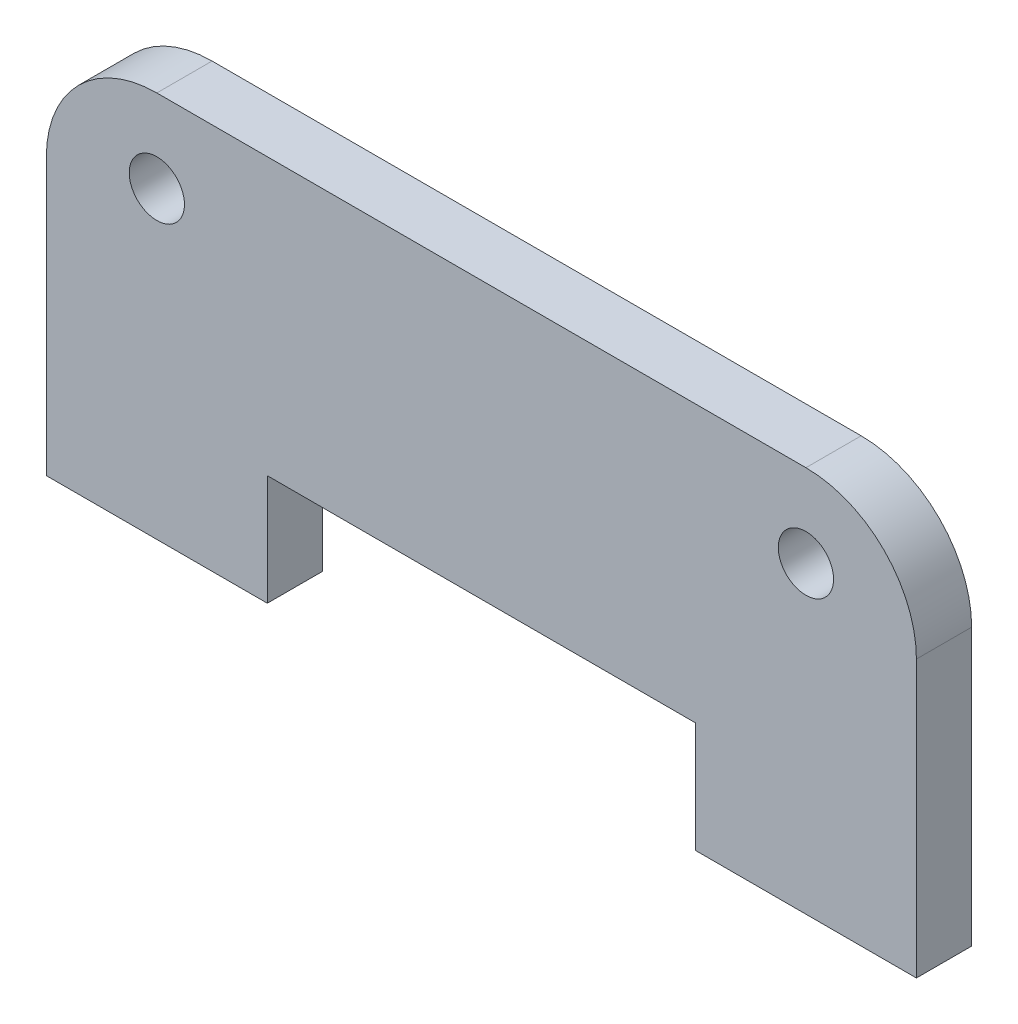
ISO-10303-21;
HEADER;
FILE_DESCRIPTION(('STEP AP214'),'2;1');
FILE_NAME('part.step','',(''),(''),'','','');
FILE_SCHEMA(('AUTOMOTIVE_DESIGN { 1 0 10303 214 1 1 1 1 }'));
ENDSEC;
DATA;
#1=APPLICATION_CONTEXT('core data for automotive mechanical design processes');
#2=APPLICATION_PROTOCOL_DEFINITION('international standard','automotive_design',2000,#1);
#3=PRODUCT_CONTEXT('',#1,'mechanical');
#4=PRODUCT('Part','Part','',(#3));
#5=PRODUCT_RELATED_PRODUCT_CATEGORY('part','',(#4));
#6=PRODUCT_DEFINITION_FORMATION('','',#4);
#7=PRODUCT_DEFINITION_CONTEXT('part definition',#1,'design');
#8=PRODUCT_DEFINITION('design','',#6,#7);
#9=PRODUCT_DEFINITION_SHAPE('','',#8);
#10=(LENGTH_UNIT() NAMED_UNIT(*) SI_UNIT(.MILLI.,.METRE.));
#11=(NAMED_UNIT(*) PLANE_ANGLE_UNIT() SI_UNIT($,.RADIAN.));
#12=(NAMED_UNIT(*) SI_UNIT($,.STERADIAN.) SOLID_ANGLE_UNIT());
#13=UNCERTAINTY_MEASURE_WITH_UNIT(LENGTH_MEASURE(1.E-05),#10,'distance_accuracy_value','');
#14=(GEOMETRIC_REPRESENTATION_CONTEXT(3) GLOBAL_UNCERTAINTY_ASSIGNED_CONTEXT((#13)) GLOBAL_UNIT_ASSIGNED_CONTEXT((#10,
#11,#12)) REPRESENTATION_CONTEXT('',''));
#15=CARTESIAN_POINT('',(0.,0.,0.));
#16=DIRECTION('',(0.,0.,1.));
#17=DIRECTION('',(1.,0.,0.));
#18=AXIS2_PLACEMENT_3D('',#15,#16,#17);
#19=CARTESIAN_POINT('',(-11.75,-1.,2.));
#20=DIRECTION('',(0.,0.,1.));
#21=DIRECTION('',(1.,0.,0.));
#22=AXIS2_PLACEMENT_3D('',#19,#20,#21);
#23=PLANE('',#22);
#24=CARTESIAN_POINT('',(-11.75,0.,2.));
#25=DIRECTION('',(0.,0.,1.));
#26=DIRECTION('',(1.,0.,0.));
#27=AXIS2_PLACEMENT_3D('',#24,#25,#26);
#28=CIRCLE('',#27,0.999999999999998);
#29=CARTESIAN_POINT('',(-10.75,0.,2.));
#30=VERTEX_POINT('',#29);
#31=EDGE_CURVE('E143',#30,#30,#28,.T.);
#32=ORIENTED_EDGE('',*,*,#31,.F.);
#33=EDGE_LOOP('',(#32));
#34=FACE_BOUND('',#33,.T.);
#35=DIRECTION('',(0.,1.,0.));
#36=VECTOR('',#35,1.);
#37=CARTESIAN_POINT('',(15.75,-7.,2.));
#38=LINE('',#37,#36);
#39=CARTESIAN_POINT('',(15.75,-11.,2.));
#40=VERTEX_POINT('',#39);
#41=CARTESIAN_POINT('',(15.75,-1.,2.));
#42=VERTEX_POINT('',#41);
#43=EDGE_CURVE('E97',#40,#42,#38,.T.);
#44=ORIENTED_EDGE('',*,*,#43,.T.);
#45=CARTESIAN_POINT('',(11.75,-1.,2.));
#46=DIRECTION('',(0.,0.,1.));
#47=DIRECTION('',(1.,0.,0.));
#48=AXIS2_PLACEMENT_3D('',#45,#46,#47);
#49=CIRCLE('',#48,4.);
#50=CARTESIAN_POINT('',(11.75,3.,2.));
#51=VERTEX_POINT('',#50);
#52=EDGE_CURVE('E206',#42,#51,#49,.T.);
#53=ORIENTED_EDGE('',*,*,#52,.T.);
#54=DIRECTION('',(-1.,0.,0.));
#55=VECTOR('',#54,1.);
#56=CARTESIAN_POINT('',(-11.75,3.,2.));
#57=LINE('',#56,#55);
#58=CARTESIAN_POINT('',(-11.75,3.,2.));
#59=VERTEX_POINT('',#58);
#60=EDGE_CURVE('E182',#51,#59,#57,.T.);
#61=ORIENTED_EDGE('',*,*,#60,.T.);
#62=CARTESIAN_POINT('',(-11.75,-1.,2.));
#63=DIRECTION('',(0.,0.,1.));
#64=DIRECTION('',(1.,0.,0.));
#65=AXIS2_PLACEMENT_3D('',#62,#63,#64);
#66=CIRCLE('',#65,4.);
#67=CARTESIAN_POINT('',(-15.75,-1.,2.));
#68=VERTEX_POINT('',#67);
#69=EDGE_CURVE('E200',#59,#68,#66,.T.);
#70=ORIENTED_EDGE('',*,*,#69,.T.);
#71=DIRECTION('',(0.,-1.,0.));
#72=VECTOR('',#71,1.);
#73=CARTESIAN_POINT('',(-15.75,-1.,2.));
#74=LINE('',#73,#72);
#75=CARTESIAN_POINT('',(-15.75,-11.,2.));
#76=VERTEX_POINT('',#75);
#77=EDGE_CURVE('E197',#68,#76,#74,.T.);
#78=ORIENTED_EDGE('',*,*,#77,.T.);
#79=DIRECTION('',(1.,0.,0.));
#80=VECTOR('',#79,1.);
#81=CARTESIAN_POINT('',(-15.75,-11.,2.));
#82=LINE('',#81,#80);
#83=CARTESIAN_POINT('',(-7.75,-11.,2.));
#84=VERTEX_POINT('',#83);
#85=EDGE_CURVE('E199',#76,#84,#82,.T.);
#86=ORIENTED_EDGE('',*,*,#85,.T.);
#87=DIRECTION('',(0.,1.,0.));
#88=VECTOR('',#87,1.);
#89=CARTESIAN_POINT('',(-7.75,-11.,2.));
#90=LINE('',#89,#88);
#91=CARTESIAN_POINT('',(-7.75,-7.,2.));
#92=VERTEX_POINT('',#91);
#93=EDGE_CURVE('E123',#84,#92,#90,.T.);
#94=ORIENTED_EDGE('',*,*,#93,.T.);
#95=DIRECTION('',(1.,0.,0.));
#96=VECTOR('',#95,1.);
#97=CARTESIAN_POINT('',(-7.75,-7.,2.));
#98=LINE('',#97,#96);
#99=CARTESIAN_POINT('',(7.75,-7.,2.));
#100=VERTEX_POINT('',#99);
#101=EDGE_CURVE('E117',#92,#100,#98,.T.);
#102=ORIENTED_EDGE('',*,*,#101,.T.);
#103=DIRECTION('',(0.,-1.,0.));
#104=VECTOR('',#103,1.);
#105=CARTESIAN_POINT('',(7.75,-11.,2.));
#106=LINE('',#105,#104);
#107=CARTESIAN_POINT('',(7.75,-11.,2.));
#108=VERTEX_POINT('',#107);
#109=EDGE_CURVE('E121',#100,#108,#106,.T.);
#110=ORIENTED_EDGE('',*,*,#109,.T.);
#111=DIRECTION('',(1.,0.,0.));
#112=VECTOR('',#111,1.);
#113=CARTESIAN_POINT('',(15.75,-11.,2.));
#114=LINE('',#113,#112);
#115=EDGE_CURVE('E49',#108,#40,#114,.T.);
#116=ORIENTED_EDGE('',*,*,#115,.T.);
#117=EDGE_LOOP('',(#44,#53,#61,#70,#78,#86,#94,#102,#110,#116));
#118=FACE_BOUND('',#117,.T.);
#119=CARTESIAN_POINT('',(11.75,0.,2.));
#120=DIRECTION('',(0.,0.,1.));
#121=DIRECTION('',(1.,0.,0.));
#122=AXIS2_PLACEMENT_3D('',#119,#120,#121);
#123=CIRCLE('',#122,1.);
#124=CARTESIAN_POINT('',(12.75,0.,2.));
#125=VERTEX_POINT('',#124);
#126=EDGE_CURVE('E212',#125,#125,#123,.T.);
#127=ORIENTED_EDGE('',*,*,#126,.F.);
#128=EDGE_LOOP('',(#127));
#129=FACE_BOUND('',#128,.T.);
#130=ADVANCED_FACE('F32',(#34,#118,#129),#23,.T.);
#131=CARTESIAN_POINT('',(-11.75,-1.,0.));
#132=DIRECTION('',(0.,0.,1.));
#133=DIRECTION('',(1.,0.,0.));
#134=AXIS2_PLACEMENT_3D('',#131,#132,#133);
#135=PLANE('',#134);
#136=CARTESIAN_POINT('',(-11.75,0.,0.));
#137=DIRECTION('',(0.,0.,1.));
#138=DIRECTION('',(1.,0.,0.));
#139=AXIS2_PLACEMENT_3D('',#136,#137,#138);
#140=CIRCLE('',#139,0.999999999999998);
#141=CARTESIAN_POINT('',(-10.75,0.,0.));
#142=VERTEX_POINT('',#141);
#143=EDGE_CURVE('E209',#142,#142,#140,.T.);
#144=ORIENTED_EDGE('',*,*,#143,.T.);
#145=EDGE_LOOP('',(#144));
#146=FACE_BOUND('',#145,.T.);
#147=DIRECTION('',(0.,1.,0.));
#148=VECTOR('',#147,1.);
#149=CARTESIAN_POINT('',(15.75,-1.,0.));
#150=LINE('',#149,#148);
#151=CARTESIAN_POINT('',(15.75,-11.,0.));
#152=VERTEX_POINT('',#151);
#153=CARTESIAN_POINT('',(15.75,-1.,0.));
#154=VERTEX_POINT('',#153);
#155=EDGE_CURVE('E91',#152,#154,#150,.T.);
#156=ORIENTED_EDGE('',*,*,#155,.F.);
#157=DIRECTION('',(1.,0.,0.));
#158=VECTOR('',#157,1.);
#159=CARTESIAN_POINT('',(15.75,-11.,0.));
#160=LINE('',#159,#158);
#161=CARTESIAN_POINT('',(7.75,-11.,0.));
#162=VERTEX_POINT('',#161);
#163=EDGE_CURVE('E158',#162,#152,#160,.T.);
#164=ORIENTED_EDGE('',*,*,#163,.F.);
#165=DIRECTION('',(0.,-1.,0.));
#166=VECTOR('',#165,1.);
#167=CARTESIAN_POINT('',(7.75,-11.,0.));
#168=LINE('',#167,#166);
#169=CARTESIAN_POINT('',(7.75,-7.,0.));
#170=VERTEX_POINT('',#169);
#171=EDGE_CURVE('E84',#170,#162,#168,.T.);
#172=ORIENTED_EDGE('',*,*,#171,.F.);
#173=DIRECTION('',(1.,0.,0.));
#174=VECTOR('',#173,1.);
#175=CARTESIAN_POINT('',(-7.75,-7.,0.));
#176=LINE('',#175,#174);
#177=CARTESIAN_POINT('',(-7.75,-7.,0.));
#178=VERTEX_POINT('',#177);
#179=EDGE_CURVE('E131',#178,#170,#176,.T.);
#180=ORIENTED_EDGE('',*,*,#179,.F.);
#181=DIRECTION('',(0.,1.,0.));
#182=VECTOR('',#181,1.);
#183=CARTESIAN_POINT('',(-7.75,-11.,0.));
#184=LINE('',#183,#182);
#185=CARTESIAN_POINT('',(-7.75,-11.,0.));
#186=VERTEX_POINT('',#185);
#187=EDGE_CURVE('E154',#186,#178,#184,.T.);
#188=ORIENTED_EDGE('',*,*,#187,.F.);
#189=DIRECTION('',(1.,0.,0.));
#190=VECTOR('',#189,1.);
#191=CARTESIAN_POINT('',(-15.75,-11.,0.));
#192=LINE('',#191,#190);
#193=CARTESIAN_POINT('',(-15.75,-11.,0.));
#194=VERTEX_POINT('',#193);
#195=EDGE_CURVE('E152',#194,#186,#192,.T.);
#196=ORIENTED_EDGE('',*,*,#195,.F.);
#197=DIRECTION('',(0.,-1.,0.));
#198=VECTOR('',#197,1.);
#199=CARTESIAN_POINT('',(-15.75,-7.,0.));
#200=LINE('',#199,#198);
#201=CARTESIAN_POINT('',(-15.75,-1.,0.));
#202=VERTEX_POINT('',#201);
#203=EDGE_CURVE('E150',#202,#194,#200,.T.);
#204=ORIENTED_EDGE('',*,*,#203,.F.);
#205=CARTESIAN_POINT('',(-11.75,-1.,0.));
#206=DIRECTION('',(0.,0.,1.));
#207=DIRECTION('',(1.,0.,0.));
#208=AXIS2_PLACEMENT_3D('',#205,#206,#207);
#209=CIRCLE('',#208,4.);
#210=CARTESIAN_POINT('',(-11.75,3.,0.));
#211=VERTEX_POINT('',#210);
#212=EDGE_CURVE('E147',#211,#202,#209,.T.);
#213=ORIENTED_EDGE('',*,*,#212,.F.);
#214=DIRECTION('',(-1.,0.,0.));
#215=VECTOR('',#214,1.);
#216=CARTESIAN_POINT('',(-11.75,3.,0.));
#217=LINE('',#216,#215);
#218=CARTESIAN_POINT('',(11.75,3.,0.));
#219=VERTEX_POINT('',#218);
#220=EDGE_CURVE('E145',#219,#211,#217,.T.);
#221=ORIENTED_EDGE('',*,*,#220,.F.);
#222=CARTESIAN_POINT('',(11.75,-1.,0.));
#223=DIRECTION('',(0.,0.,1.));
#224=DIRECTION('',(1.,0.,0.));
#225=AXIS2_PLACEMENT_3D('',#222,#223,#224);
#226=CIRCLE('',#225,4.);
#227=EDGE_CURVE('E142',#154,#219,#226,.T.);
#228=ORIENTED_EDGE('',*,*,#227,.F.);
#229=EDGE_LOOP('',(#156,#164,#172,#180,#188,#196,#204,#213,#221,#228));
#230=FACE_BOUND('',#229,.T.);
#231=CARTESIAN_POINT('',(11.75,0.,0.));
#232=DIRECTION('',(0.,0.,1.));
#233=DIRECTION('',(1.,0.,0.));
#234=AXIS2_PLACEMENT_3D('',#231,#232,#233);
#235=CIRCLE('',#234,1.);
#236=CARTESIAN_POINT('',(12.75,0.,0.));
#237=VERTEX_POINT('',#236);
#238=EDGE_CURVE('E215',#237,#237,#235,.T.);
#239=ORIENTED_EDGE('',*,*,#238,.T.);
#240=EDGE_LOOP('',(#239));
#241=FACE_BOUND('',#240,.T.);
#242=ADVANCED_FACE('F186',(#146,#230,#241),#135,.F.);
#243=CARTESIAN_POINT('',(15.75,-1.,2.));
#244=DIRECTION('',(-1.,0.,0.));
#245=DIRECTION('',(0.,0.,1.));
#246=AXIS2_PLACEMENT_3D('',#243,#244,#245);
#247=PLANE('',#246);
#248=ORIENTED_EDGE('',*,*,#155,.T.);
#249=DIRECTION('',(0.,0.,-1.));
#250=VECTOR('',#249,1.);
#251=CARTESIAN_POINT('',(15.75,-1.,2.));
#252=LINE('',#251,#250);
#253=EDGE_CURVE('E11',#42,#154,#252,.T.);
#254=ORIENTED_EDGE('',*,*,#253,.F.);
#255=ORIENTED_EDGE('',*,*,#43,.F.);
#256=DIRECTION('',(0.,0.,-1.));
#257=VECTOR('',#256,1.);
#258=CARTESIAN_POINT('',(15.75,-11.,2.));
#259=LINE('',#258,#257);
#260=EDGE_CURVE('E137',#40,#152,#259,.T.);
#261=ORIENTED_EDGE('',*,*,#260,.T.);
#262=EDGE_LOOP('',(#248,#254,#255,#261));
#263=FACE_BOUND('',#262,.T.);
#264=ADVANCED_FACE('F34',(#263),#247,.F.);
#265=CARTESIAN_POINT('',(11.75,-1.,2.));
#266=DIRECTION('',(0.,0.,-1.));
#267=DIRECTION('',(-1.,0.,0.));
#268=AXIS2_PLACEMENT_3D('',#265,#266,#267);
#269=CYLINDRICAL_SURFACE('',#268,4.);
#270=ORIENTED_EDGE('',*,*,#227,.T.);
#271=DIRECTION('',(0.,0.,-1.));
#272=VECTOR('',#271,1.);
#273=CARTESIAN_POINT('',(11.75,3.,2.));
#274=LINE('',#273,#272);
#275=EDGE_CURVE('E41',#51,#219,#274,.T.);
#276=ORIENTED_EDGE('',*,*,#275,.F.);
#277=ORIENTED_EDGE('',*,*,#52,.F.);
#278=ORIENTED_EDGE('',*,*,#253,.T.);
#279=EDGE_LOOP('',(#270,#276,#277,#278));
#280=FACE_BOUND('',#279,.T.);
#281=ADVANCED_FACE('F257',(#280),#269,.T.);
#282=CARTESIAN_POINT('',(-11.75,3.,2.));
#283=DIRECTION('',(0.,-1.,0.));
#284=DIRECTION('',(0.,0.,-1.));
#285=AXIS2_PLACEMENT_3D('',#282,#283,#284);
#286=PLANE('',#285);
#287=ORIENTED_EDGE('',*,*,#220,.T.);
#288=DIRECTION('',(0.,0.,-1.));
#289=VECTOR('',#288,1.);
#290=CARTESIAN_POINT('',(-11.75,3.,2.));
#291=LINE('',#290,#289);
#292=EDGE_CURVE('E173',#59,#211,#291,.T.);
#293=ORIENTED_EDGE('',*,*,#292,.F.);
#294=ORIENTED_EDGE('',*,*,#60,.F.);
#295=ORIENTED_EDGE('',*,*,#275,.T.);
#296=EDGE_LOOP('',(#287,#293,#294,#295));
#297=FACE_BOUND('',#296,.T.);
#298=ADVANCED_FACE('F180',(#297),#286,.F.);
#299=CARTESIAN_POINT('',(-11.75,-1.,2.));
#300=DIRECTION('',(0.,0.,-1.));
#301=DIRECTION('',(-1.,0.,0.));
#302=AXIS2_PLACEMENT_3D('',#299,#300,#301);
#303=CYLINDRICAL_SURFACE('',#302,4.);
#304=ORIENTED_EDGE('',*,*,#212,.T.);
#305=DIRECTION('',(0.,0.,-1.));
#306=VECTOR('',#305,1.);
#307=CARTESIAN_POINT('',(-15.75,-1.,2.));
#308=LINE('',#307,#306);
#309=EDGE_CURVE('E170',#68,#202,#308,.T.);
#310=ORIENTED_EDGE('',*,*,#309,.F.);
#311=ORIENTED_EDGE('',*,*,#69,.F.);
#312=ORIENTED_EDGE('',*,*,#292,.T.);
#313=EDGE_LOOP('',(#304,#310,#311,#312));
#314=FACE_BOUND('',#313,.T.);
#315=ADVANCED_FACE('F191',(#314),#303,.T.);
#316=CARTESIAN_POINT('',(-15.75,-7.,2.));
#317=DIRECTION('',(1.,0.,0.));
#318=DIRECTION('',(0.,0.,-1.));
#319=AXIS2_PLACEMENT_3D('',#316,#317,#318);
#320=PLANE('',#319);
#321=ORIENTED_EDGE('',*,*,#203,.T.);
#322=DIRECTION('',(0.,0.,-1.));
#323=VECTOR('',#322,1.);
#324=CARTESIAN_POINT('',(-15.75,-11.,2.));
#325=LINE('',#324,#323);
#326=EDGE_CURVE('E167',#76,#194,#325,.T.);
#327=ORIENTED_EDGE('',*,*,#326,.F.);
#328=ORIENTED_EDGE('',*,*,#77,.F.);
#329=ORIENTED_EDGE('',*,*,#309,.T.);
#330=EDGE_LOOP('',(#321,#327,#328,#329));
#331=FACE_BOUND('',#330,.T.);
#332=ADVANCED_FACE('F195',(#331),#320,.F.);
#333=CARTESIAN_POINT('',(-15.75,-11.,2.));
#334=DIRECTION('',(0.,1.,0.));
#335=DIRECTION('',(0.,0.,1.));
#336=AXIS2_PLACEMENT_3D('',#333,#334,#335);
#337=PLANE('',#336);
#338=ORIENTED_EDGE('',*,*,#195,.T.);
#339=DIRECTION('',(0.,0.,-1.));
#340=VECTOR('',#339,1.);
#341=CARTESIAN_POINT('',(-7.75,-11.,2.));
#342=LINE('',#341,#340);
#343=EDGE_CURVE('E164',#84,#186,#342,.T.);
#344=ORIENTED_EDGE('',*,*,#343,.F.);
#345=ORIENTED_EDGE('',*,*,#85,.F.);
#346=ORIENTED_EDGE('',*,*,#326,.T.);
#347=EDGE_LOOP('',(#338,#344,#345,#346));
#348=FACE_BOUND('',#347,.T.);
#349=ADVANCED_FACE('F247',(#348),#337,.F.);
#350=CARTESIAN_POINT('',(-7.75,-11.,2.));
#351=DIRECTION('',(-1.,0.,0.));
#352=DIRECTION('',(0.,0.,1.));
#353=AXIS2_PLACEMENT_3D('',#350,#351,#352);
#354=PLANE('',#353);
#355=ORIENTED_EDGE('',*,*,#187,.T.);
#356=DIRECTION('',(0.,0.,-1.));
#357=VECTOR('',#356,1.);
#358=CARTESIAN_POINT('',(-7.75,-7.,2.));
#359=LINE('',#358,#357);
#360=EDGE_CURVE('E132',#92,#178,#359,.T.);
#361=ORIENTED_EDGE('',*,*,#360,.F.);
#362=ORIENTED_EDGE('',*,*,#93,.F.);
#363=ORIENTED_EDGE('',*,*,#343,.T.);
#364=EDGE_LOOP('',(#355,#361,#362,#363));
#365=FACE_BOUND('',#364,.T.);
#366=ADVANCED_FACE('F244',(#365),#354,.F.);
#367=CARTESIAN_POINT('',(-7.75,-7.,2.));
#368=DIRECTION('',(0.,1.,0.));
#369=DIRECTION('',(0.,0.,1.));
#370=AXIS2_PLACEMENT_3D('',#367,#368,#369);
#371=PLANE('',#370);
#372=ORIENTED_EDGE('',*,*,#179,.T.);
#373=DIRECTION('',(0.,0.,-1.));
#374=VECTOR('',#373,1.);
#375=CARTESIAN_POINT('',(7.75,-7.,2.));
#376=LINE('',#375,#374);
#377=EDGE_CURVE('E128',#100,#170,#376,.T.);
#378=ORIENTED_EDGE('',*,*,#377,.F.);
#379=ORIENTED_EDGE('',*,*,#101,.F.);
#380=ORIENTED_EDGE('',*,*,#360,.T.);
#381=EDGE_LOOP('',(#372,#378,#379,#380));
#382=FACE_BOUND('',#381,.T.);
#383=ADVANCED_FACE('F129',(#382),#371,.F.);
#384=CARTESIAN_POINT('',(7.75,-11.,2.));
#385=DIRECTION('',(1.,0.,0.));
#386=DIRECTION('',(0.,0.,-1.));
#387=AXIS2_PLACEMENT_3D('',#384,#385,#386);
#388=PLANE('',#387);
#389=ORIENTED_EDGE('',*,*,#171,.T.);
#390=DIRECTION('',(0.,0.,-1.));
#391=VECTOR('',#390,1.);
#392=CARTESIAN_POINT('',(7.75,-11.,2.));
#393=LINE('',#392,#391);
#394=EDGE_CURVE('E133',#108,#162,#393,.T.);
#395=ORIENTED_EDGE('',*,*,#394,.F.);
#396=ORIENTED_EDGE('',*,*,#109,.F.);
#397=ORIENTED_EDGE('',*,*,#377,.T.);
#398=EDGE_LOOP('',(#389,#395,#396,#397));
#399=FACE_BOUND('',#398,.T.);
#400=ADVANCED_FACE('F135',(#399),#388,.F.);
#401=CARTESIAN_POINT('',(15.75,-11.,2.));
#402=DIRECTION('',(0.,1.,0.));
#403=DIRECTION('',(0.,0.,1.));
#404=AXIS2_PLACEMENT_3D('',#401,#402,#403);
#405=PLANE('',#404);
#406=ORIENTED_EDGE('',*,*,#163,.T.);
#407=ORIENTED_EDGE('',*,*,#260,.F.);
#408=ORIENTED_EDGE('',*,*,#115,.F.);
#409=ORIENTED_EDGE('',*,*,#394,.T.);
#410=EDGE_LOOP('',(#406,#407,#408,#409));
#411=FACE_BOUND('',#410,.T.);
#412=ADVANCED_FACE('F236',(#411),#405,.F.);
#413=CARTESIAN_POINT('',(-11.75,0.,2.));
#414=DIRECTION('',(0.,0.,-1.));
#415=DIRECTION('',(-1.,0.,0.));
#416=AXIS2_PLACEMENT_3D('',#413,#414,#415);
#417=CYLINDRICAL_SURFACE('',#416,0.999999999999998);
#418=ORIENTED_EDGE('',*,*,#31,.T.);
#419=EDGE_LOOP('',(#418));
#420=FACE_BOUND('',#419,.T.);
#421=ORIENTED_EDGE('',*,*,#143,.F.);
#422=EDGE_LOOP('',(#421));
#423=FACE_BOUND('',#422,.T.);
#424=ADVANCED_FACE('F233',(#420,#423),#417,.F.);
#425=CARTESIAN_POINT('',(11.75,0.,2.));
#426=DIRECTION('',(0.,0.,-1.));
#427=DIRECTION('',(-1.,0.,0.));
#428=AXIS2_PLACEMENT_3D('',#425,#426,#427);
#429=CYLINDRICAL_SURFACE('',#428,1.);
#430=ORIENTED_EDGE('',*,*,#126,.T.);
#431=EDGE_LOOP('',(#430));
#432=FACE_BOUND('',#431,.T.);
#433=ORIENTED_EDGE('',*,*,#238,.F.);
#434=EDGE_LOOP('',(#433));
#435=FACE_BOUND('',#434,.T.);
#436=ADVANCED_FACE('F221',(#432,#435),#429,.F.);
#437=CLOSED_SHELL('',(#130,#242,#264,#281,#298,#315,#332,#349,#366,#383,#400,#412,#424,#436));
#438=MANIFOLD_SOLID_BREP('B2',#437);
#439=ADVANCED_BREP_SHAPE_REPRESENTATION('',(#18,#438),#14);
#440=SHAPE_DEFINITION_REPRESENTATION(#9,#439);
ENDSEC;
END-ISO-10303-21;
